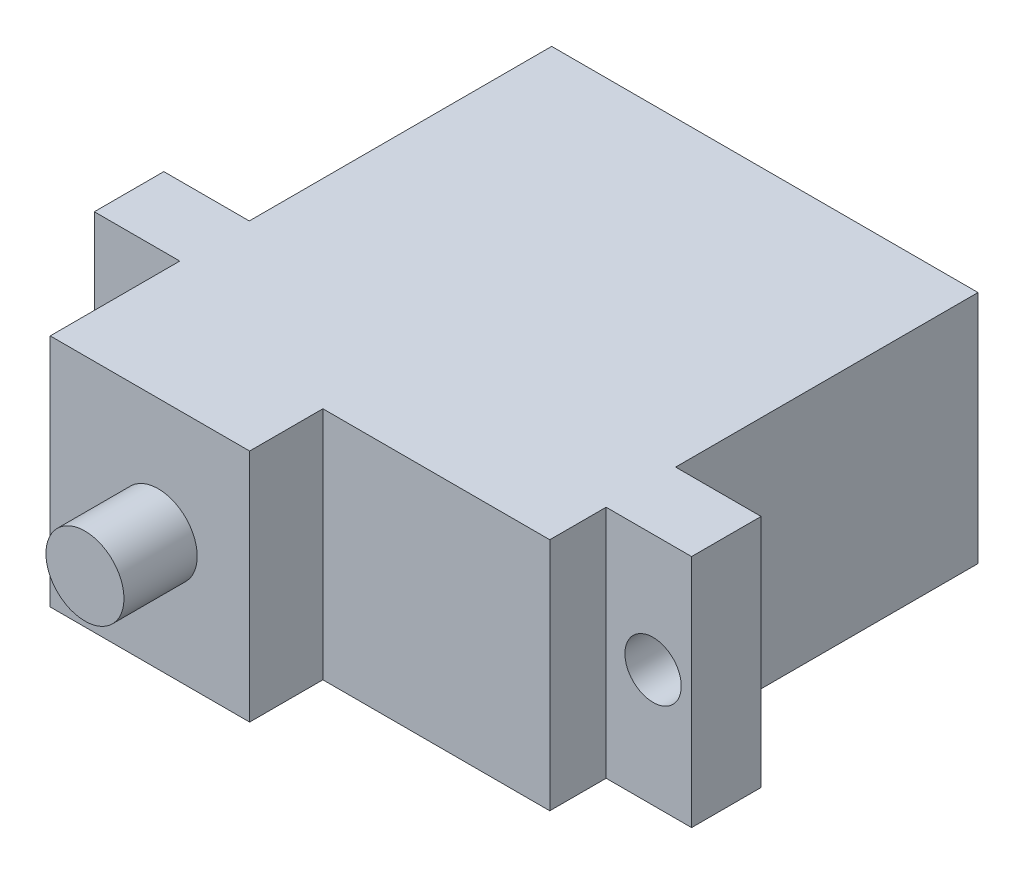
ISO-10303-21;
HEADER;
FILE_DESCRIPTION(('STEP AP214'),'2;1');
FILE_NAME('part.step','',(''),(''),'','','');
FILE_SCHEMA(('AUTOMOTIVE_DESIGN { 1 0 10303 214 1 1 1 1 }'));
ENDSEC;
DATA;
#1=APPLICATION_CONTEXT('core data for automotive mechanical design processes');
#2=APPLICATION_PROTOCOL_DEFINITION('international standard','automotive_design',2000,#1);
#3=PRODUCT_CONTEXT('',#1,'mechanical');
#4=PRODUCT('Part','Part','',(#3));
#5=PRODUCT_RELATED_PRODUCT_CATEGORY('part','',(#4));
#6=PRODUCT_DEFINITION_FORMATION('','',#4);
#7=PRODUCT_DEFINITION_CONTEXT('part definition',#1,'design');
#8=PRODUCT_DEFINITION('design','',#6,#7);
#9=PRODUCT_DEFINITION_SHAPE('','',#8);
#10=(LENGTH_UNIT() NAMED_UNIT(*) SI_UNIT(.MILLI.,.METRE.));
#11=(NAMED_UNIT(*) PLANE_ANGLE_UNIT() SI_UNIT($,.RADIAN.));
#12=(NAMED_UNIT(*) SI_UNIT($,.STERADIAN.) SOLID_ANGLE_UNIT());
#13=UNCERTAINTY_MEASURE_WITH_UNIT(LENGTH_MEASURE(1.E-05),#10,'distance_accuracy_value','');
#14=(GEOMETRIC_REPRESENTATION_CONTEXT(3) GLOBAL_UNCERTAINTY_ASSIGNED_CONTEXT((#13)) GLOBAL_UNIT_ASSIGNED_CONTEXT((#10,
#11,#12)) REPRESENTATION_CONTEXT('',''));
#15=CARTESIAN_POINT('',(0.,0.,0.));
#16=DIRECTION('',(0.,0.,1.));
#17=DIRECTION('',(1.,0.,0.));
#18=AXIS2_PLACEMENT_3D('',#15,#16,#17);
#19=CARTESIAN_POINT('',(11.35,6.25,22.8));
#20=DIRECTION('',(-1.,0.,0.));
#21=DIRECTION('',(0.,0.,1.));
#22=AXIS2_PLACEMENT_3D('',#19,#20,#21);
#23=PLANE('',#22);
#24=DIRECTION('',(0.,0.,-1.));
#25=VECTOR('',#24,1.);
#26=CARTESIAN_POINT('',(11.35,6.25,22.8));
#27=LINE('',#26,#25);
#28=CARTESIAN_POINT('',(11.35,6.25,16.1));
#29=VERTEX_POINT('',#28);
#30=CARTESIAN_POINT('',(11.35,6.25,0.));
#31=VERTEX_POINT('',#30);
#32=EDGE_CURVE('E44',#29,#31,#27,.T.);
#33=ORIENTED_EDGE('',*,*,#32,.F.);
#34=DIRECTION('',(0.,-1.,0.));
#35=VECTOR('',#34,1.);
#36=CARTESIAN_POINT('',(11.35,0.,16.1));
#37=LINE('',#36,#35);
#38=CARTESIAN_POINT('',(11.35,-6.25,16.1));
#39=VERTEX_POINT('',#38);
#40=EDGE_CURVE('E217',#29,#39,#37,.T.);
#41=ORIENTED_EDGE('',*,*,#40,.T.);
#42=DIRECTION('',(0.,0.,-1.));
#43=VECTOR('',#42,1.);
#44=CARTESIAN_POINT('',(11.35,-6.25,22.8));
#45=LINE('',#44,#43);
#46=CARTESIAN_POINT('',(11.35,-6.25,0.));
#47=VERTEX_POINT('',#46);
#48=EDGE_CURVE('E255',#39,#47,#45,.T.);
#49=ORIENTED_EDGE('',*,*,#48,.T.);
#50=DIRECTION('',(0.,1.,0.));
#51=VECTOR('',#50,1.);
#52=CARTESIAN_POINT('',(11.35,6.25,0.));
#53=LINE('',#52,#51);
#54=EDGE_CURVE('E249',#47,#31,#53,.T.);
#55=ORIENTED_EDGE('',*,*,#54,.T.);
#56=EDGE_LOOP('',(#33,#41,#49,#55));
#57=FACE_BOUND('',#56,.T.);
#58=ADVANCED_FACE('F41',(#57),#23,.F.);
#59=CARTESIAN_POINT('',(-11.35,6.25,22.8));
#60=DIRECTION('',(0.,-1.,0.));
#61=DIRECTION('',(0.,0.,-1.));
#62=AXIS2_PLACEMENT_3D('',#59,#60,#61);
#63=PLANE('',#62);
#64=DIRECTION('',(1.,0.,0.));
#65=VECTOR('',#64,1.);
#66=CARTESIAN_POINT('',(-15.9,6.25,19.8));
#67=LINE('',#66,#65);
#68=CARTESIAN_POINT('',(-15.9,6.25,19.8));
#69=VERTEX_POINT('',#68);
#70=CARTESIAN_POINT('',(-11.35,6.25,19.8));
#71=VERTEX_POINT('',#70);
#72=EDGE_CURVE('E64',#69,#71,#67,.T.);
#73=ORIENTED_EDGE('',*,*,#72,.T.);
#74=DIRECTION('',(0.,0.,1.));
#75=VECTOR('',#74,1.);
#76=CARTESIAN_POINT('',(-11.35,6.25,22.8));
#77=LINE('',#76,#75);
#78=CARTESIAN_POINT('',(-11.35,6.25,26.7));
#79=VERTEX_POINT('',#78);
#80=EDGE_CURVE('E192',#71,#79,#77,.T.);
#81=ORIENTED_EDGE('',*,*,#80,.T.);
#82=DIRECTION('',(-1.,0.,0.));
#83=VECTOR('',#82,1.);
#84=CARTESIAN_POINT('',(-11.35,6.25,26.7));
#85=LINE('',#84,#83);
#86=CARTESIAN_POINT('',(-0.73128607064632,6.25,26.7));
#87=VERTEX_POINT('',#86);
#88=EDGE_CURVE('E166',#87,#79,#85,.T.);
#89=ORIENTED_EDGE('',*,*,#88,.F.);
#90=DIRECTION('',(0.,0.,-1.));
#91=VECTOR('',#90,1.);
#92=CARTESIAN_POINT('',(-0.73128607064632,6.25,26.7));
#93=LINE('',#92,#91);
#94=CARTESIAN_POINT('',(-0.73128607064632,6.25,22.8));
#95=VERTEX_POINT('',#94);
#96=EDGE_CURVE('E173',#87,#95,#93,.T.);
#97=ORIENTED_EDGE('',*,*,#96,.T.);
#98=DIRECTION('',(-1.,0.,0.));
#99=VECTOR('',#98,1.);
#100=CARTESIAN_POINT('',(-11.35,6.25,22.8));
#101=LINE('',#100,#99);
#102=CARTESIAN_POINT('',(11.35,6.25,22.8));
#103=VERTEX_POINT('',#102);
#104=EDGE_CURVE('E250',#103,#95,#101,.T.);
#105=ORIENTED_EDGE('',*,*,#104,.F.);
#106=DIRECTION('',(0.,0.,-1.));
#107=VECTOR('',#106,1.);
#108=CARTESIAN_POINT('',(11.35,6.25,22.8));
#109=LINE('',#108,#107);
#110=CARTESIAN_POINT('',(11.35,6.25,19.8));
#111=VERTEX_POINT('',#110);
#112=EDGE_CURVE('E200',#103,#111,#109,.T.);
#113=ORIENTED_EDGE('',*,*,#112,.T.);
#114=DIRECTION('',(1.,0.,0.));
#115=VECTOR('',#114,1.);
#116=CARTESIAN_POINT('',(15.9,6.25,19.8));
#117=LINE('',#116,#115);
#118=CARTESIAN_POINT('',(15.9,6.25,19.8));
#119=VERTEX_POINT('',#118);
#120=EDGE_CURVE('E203',#111,#119,#117,.T.);
#121=ORIENTED_EDGE('',*,*,#120,.T.);
#122=DIRECTION('',(0.,0.,1.));
#123=VECTOR('',#122,1.);
#124=CARTESIAN_POINT('',(15.9,6.25,-13.3023494165505));
#125=LINE('',#124,#123);
#126=CARTESIAN_POINT('',(15.9,6.25,16.1));
#127=VERTEX_POINT('',#126);
#128=EDGE_CURVE('E198',#127,#119,#125,.T.);
#129=ORIENTED_EDGE('',*,*,#128,.F.);
#130=DIRECTION('',(-1.,0.,0.));
#131=VECTOR('',#130,1.);
#132=CARTESIAN_POINT('',(0.,6.25,16.1));
#133=LINE('',#132,#131);
#134=EDGE_CURVE('E221',#127,#29,#133,.T.);
#135=ORIENTED_EDGE('',*,*,#134,.T.);
#136=ORIENTED_EDGE('',*,*,#32,.T.);
#137=DIRECTION('',(-1.,0.,0.));
#138=VECTOR('',#137,1.);
#139=CARTESIAN_POINT('',(-11.35,6.25,0.));
#140=LINE('',#139,#138);
#141=CARTESIAN_POINT('',(-11.35,6.25,0.));
#142=VERTEX_POINT('',#141);
#143=EDGE_CURVE('E258',#31,#142,#140,.T.);
#144=ORIENTED_EDGE('',*,*,#143,.T.);
#145=DIRECTION('',(0.,0.,-1.));
#146=VECTOR('',#145,1.);
#147=CARTESIAN_POINT('',(-11.35,6.25,22.8));
#148=LINE('',#147,#146);
#149=CARTESIAN_POINT('',(-11.35,6.25,16.1));
#150=VERTEX_POINT('',#149);
#151=EDGE_CURVE('E268',#150,#142,#148,.T.);
#152=ORIENTED_EDGE('',*,*,#151,.F.);
#153=DIRECTION('',(-1.,0.,0.));
#154=VECTOR('',#153,1.);
#155=CARTESIAN_POINT('',(0.,6.25,16.1));
#156=LINE('',#155,#154);
#157=CARTESIAN_POINT('',(-15.9,6.25,16.1));
#158=VERTEX_POINT('',#157);
#159=EDGE_CURVE('E237',#150,#158,#156,.T.);
#160=ORIENTED_EDGE('',*,*,#159,.T.);
#161=DIRECTION('',(0.,0.,1.));
#162=VECTOR('',#161,1.);
#163=CARTESIAN_POINT('',(-15.9,6.25,-13.3023494165505));
#164=LINE('',#163,#162);
#165=EDGE_CURVE('E238',#158,#69,#164,.T.);
#166=ORIENTED_EDGE('',*,*,#165,.T.);
#167=EDGE_LOOP('',(#73,#81,#89,#97,#105,#113,#121,#129,#135,#136,#144,#152,#160,#166));
#168=FACE_BOUND('',#167,.T.);
#169=ADVANCED_FACE('F274',(#168),#63,.F.);
#170=CARTESIAN_POINT('',(-11.35,6.25,22.8));
#171=DIRECTION('',(1.,0.,0.));
#172=DIRECTION('',(0.,0.,-1.));
#173=AXIS2_PLACEMENT_3D('',#170,#171,#172);
#174=PLANE('',#173);
#175=DIRECTION('',(0.,0.,-1.));
#176=VECTOR('',#175,1.);
#177=CARTESIAN_POINT('',(-11.35,-6.25,22.8));
#178=LINE('',#177,#176);
#179=CARTESIAN_POINT('',(-11.35,-6.25,16.1));
#180=VERTEX_POINT('',#179);
#181=CARTESIAN_POINT('',(-11.35,-6.25,0.));
#182=VERTEX_POINT('',#181);
#183=EDGE_CURVE('E267',#180,#182,#178,.T.);
#184=ORIENTED_EDGE('',*,*,#183,.F.);
#185=DIRECTION('',(0.,1.,0.));
#186=VECTOR('',#185,1.);
#187=CARTESIAN_POINT('',(-11.35,0.,16.1));
#188=LINE('',#187,#186);
#189=EDGE_CURVE('E234',#180,#150,#188,.T.);
#190=ORIENTED_EDGE('',*,*,#189,.T.);
#191=ORIENTED_EDGE('',*,*,#151,.T.);
#192=DIRECTION('',(0.,-1.,0.));
#193=VECTOR('',#192,1.);
#194=CARTESIAN_POINT('',(-11.35,6.25,0.));
#195=LINE('',#194,#193);
#196=EDGE_CURVE('E261',#142,#182,#195,.T.);
#197=ORIENTED_EDGE('',*,*,#196,.T.);
#198=EDGE_LOOP('',(#184,#190,#191,#197));
#199=FACE_BOUND('',#198,.T.);
#200=ADVANCED_FACE('F287',(#199),#174,.F.);
#201=CARTESIAN_POINT('',(-11.35,-6.25,22.8));
#202=DIRECTION('',(0.,1.,0.));
#203=DIRECTION('',(0.,0.,1.));
#204=AXIS2_PLACEMENT_3D('',#201,#202,#203);
#205=PLANE('',#204);
#206=DIRECTION('',(1.,0.,0.));
#207=VECTOR('',#206,1.);
#208=CARTESIAN_POINT('',(-11.35,-6.25,22.8));
#209=LINE('',#208,#207);
#210=CARTESIAN_POINT('',(-0.73128607064632,-6.25,22.8));
#211=VERTEX_POINT('',#210);
#212=CARTESIAN_POINT('',(11.35,-6.25,22.8));
#213=VERTEX_POINT('',#212);
#214=EDGE_CURVE('E252',#211,#213,#209,.T.);
#215=ORIENTED_EDGE('',*,*,#214,.F.);
#216=DIRECTION('',(0.,0.,-1.));
#217=VECTOR('',#216,1.);
#218=CARTESIAN_POINT('',(-0.73128607064632,-6.25,26.7));
#219=LINE('',#218,#217);
#220=CARTESIAN_POINT('',(-0.73128607064632,-6.25,26.7));
#221=VERTEX_POINT('',#220);
#222=EDGE_CURVE('E158',#221,#211,#219,.T.);
#223=ORIENTED_EDGE('',*,*,#222,.F.);
#224=DIRECTION('',(1.,0.,0.));
#225=VECTOR('',#224,1.);
#226=CARTESIAN_POINT('',(-11.35,-6.25,26.7));
#227=LINE('',#226,#225);
#228=CARTESIAN_POINT('',(-11.35,-6.25,26.7));
#229=VERTEX_POINT('',#228);
#230=EDGE_CURVE('E155',#229,#221,#227,.T.);
#231=ORIENTED_EDGE('',*,*,#230,.F.);
#232=DIRECTION('',(0.,0.,1.));
#233=VECTOR('',#232,1.);
#234=CARTESIAN_POINT('',(-11.35,-6.25,22.8));
#235=LINE('',#234,#233);
#236=CARTESIAN_POINT('',(-11.35,-6.25,19.8));
#237=VERTEX_POINT('',#236);
#238=EDGE_CURVE('E142',#237,#229,#235,.T.);
#239=ORIENTED_EDGE('',*,*,#238,.F.);
#240=DIRECTION('',(1.,0.,0.));
#241=VECTOR('',#240,1.);
#242=CARTESIAN_POINT('',(-15.9,-6.25,19.8));
#243=LINE('',#242,#241);
#244=CARTESIAN_POINT('',(-15.9,-6.25,19.8));
#245=VERTEX_POINT('',#244);
#246=EDGE_CURVE('E152',#245,#237,#243,.T.);
#247=ORIENTED_EDGE('',*,*,#246,.F.);
#248=DIRECTION('',(0.,0.,1.));
#249=VECTOR('',#248,1.);
#250=CARTESIAN_POINT('',(-15.9,-6.25,-13.3023494165505));
#251=LINE('',#250,#249);
#252=CARTESIAN_POINT('',(-15.9,-6.25,16.1));
#253=VERTEX_POINT('',#252);
#254=EDGE_CURVE('E226',#253,#245,#251,.T.);
#255=ORIENTED_EDGE('',*,*,#254,.F.);
#256=DIRECTION('',(-1.,0.,0.));
#257=VECTOR('',#256,1.);
#258=CARTESIAN_POINT('',(0.,-6.25,16.1));
#259=LINE('',#258,#257);
#260=EDGE_CURVE('E243',#180,#253,#259,.T.);
#261=ORIENTED_EDGE('',*,*,#260,.F.);
#262=ORIENTED_EDGE('',*,*,#183,.T.);
#263=DIRECTION('',(1.,0.,0.));
#264=VECTOR('',#263,1.);
#265=CARTESIAN_POINT('',(-11.35,-6.25,0.));
#266=LINE('',#265,#264);
#267=EDGE_CURVE('E253',#182,#47,#266,.T.);
#268=ORIENTED_EDGE('',*,*,#267,.T.);
#269=ORIENTED_EDGE('',*,*,#48,.F.);
#270=DIRECTION('',(-1.,0.,0.));
#271=VECTOR('',#270,1.);
#272=CARTESIAN_POINT('',(0.,-6.25,16.1));
#273=LINE('',#272,#271);
#274=CARTESIAN_POINT('',(15.9,-6.25,16.1));
#275=VERTEX_POINT('',#274);
#276=EDGE_CURVE('E220',#275,#39,#273,.T.);
#277=ORIENTED_EDGE('',*,*,#276,.F.);
#278=DIRECTION('',(0.,0.,1.));
#279=VECTOR('',#278,1.);
#280=CARTESIAN_POINT('',(15.9,-6.25,-13.3023494165505));
#281=LINE('',#280,#279);
#282=CARTESIAN_POINT('',(15.9,-6.25,19.8));
#283=VERTEX_POINT('',#282);
#284=EDGE_CURVE('E227',#275,#283,#281,.T.);
#285=ORIENTED_EDGE('',*,*,#284,.T.);
#286=DIRECTION('',(1.,0.,0.));
#287=VECTOR('',#286,1.);
#288=CARTESIAN_POINT('',(15.9,-6.25,19.8));
#289=LINE('',#288,#287);
#290=CARTESIAN_POINT('',(11.35,-6.25,19.8));
#291=VERTEX_POINT('',#290);
#292=EDGE_CURVE('E204',#291,#283,#289,.T.);
#293=ORIENTED_EDGE('',*,*,#292,.F.);
#294=DIRECTION('',(0.,0.,-1.));
#295=VECTOR('',#294,1.);
#296=CARTESIAN_POINT('',(11.35,-6.25,22.8));
#297=LINE('',#296,#295);
#298=EDGE_CURVE('E190',#213,#291,#297,.T.);
#299=ORIENTED_EDGE('',*,*,#298,.F.);
#300=EDGE_LOOP('',(#215,#223,#231,#239,#247,#255,#261,#262,#268,#269,#277,#285,#293,#299));
#301=FACE_BOUND('',#300,.T.);
#302=ADVANCED_FACE('F156',(#301),#205,.F.);
#303=CARTESIAN_POINT('',(0.,0.,22.8));
#304=DIRECTION('',(0.,0.,1.));
#305=DIRECTION('',(1.,0.,0.));
#306=AXIS2_PLACEMENT_3D('',#303,#304,#305);
#307=PLANE('',#306);
#308=DIRECTION('',(0.,1.,0.));
#309=VECTOR('',#308,1.);
#310=CARTESIAN_POINT('',(-0.73128607064632,6.25,22.8));
#311=LINE('',#310,#309);
#312=EDGE_CURVE('E56',#211,#95,#311,.T.);
#313=ORIENTED_EDGE('',*,*,#312,.F.);
#314=ORIENTED_EDGE('',*,*,#214,.T.);
#315=DIRECTION('',(0.,-1.,0.));
#316=VECTOR('',#315,1.);
#317=CARTESIAN_POINT('',(11.35,6.25,22.8));
#318=LINE('',#317,#316);
#319=EDGE_CURVE('E207',#103,#213,#318,.T.);
#320=ORIENTED_EDGE('',*,*,#319,.F.);
#321=ORIENTED_EDGE('',*,*,#104,.T.);
#322=EDGE_LOOP('',(#313,#314,#320,#321));
#323=FACE_BOUND('',#322,.T.);
#324=ADVANCED_FACE('F294',(#323),#307,.T.);
#325=CARTESIAN_POINT('',(0.,0.,0.));
#326=DIRECTION('',(0.,0.,1.));
#327=DIRECTION('',(1.,0.,0.));
#328=AXIS2_PLACEMENT_3D('',#325,#326,#327);
#329=PLANE('',#328);
#330=ORIENTED_EDGE('',*,*,#54,.F.);
#331=ORIENTED_EDGE('',*,*,#267,.F.);
#332=ORIENTED_EDGE('',*,*,#196,.F.);
#333=ORIENTED_EDGE('',*,*,#143,.F.);
#334=EDGE_LOOP('',(#330,#331,#332,#333));
#335=FACE_BOUND('',#334,.T.);
#336=ADVANCED_FACE('F280',(#335),#329,.F.);
#337=CARTESIAN_POINT('',(-15.9,0.,-13.3023494165505));
#338=DIRECTION('',(-1.,0.,0.));
#339=DIRECTION('',(0.,0.,1.));
#340=AXIS2_PLACEMENT_3D('',#337,#338,#339);
#341=PLANE('',#340);
#342=DIRECTION('',(0.,-1.,0.));
#343=VECTOR('',#342,1.);
#344=CARTESIAN_POINT('',(-15.9,6.25,19.8));
#345=LINE('',#344,#343);
#346=EDGE_CURVE('E194',#69,#245,#345,.T.);
#347=ORIENTED_EDGE('',*,*,#346,.F.);
#348=ORIENTED_EDGE('',*,*,#165,.F.);
#349=DIRECTION('',(0.,1.,0.));
#350=VECTOR('',#349,1.);
#351=CARTESIAN_POINT('',(-15.9,0.,16.1));
#352=LINE('',#351,#350);
#353=EDGE_CURVE('E241',#253,#158,#352,.T.);
#354=ORIENTED_EDGE('',*,*,#353,.F.);
#355=ORIENTED_EDGE('',*,*,#254,.T.);
#356=EDGE_LOOP('',(#347,#348,#354,#355));
#357=FACE_BOUND('',#356,.T.);
#358=ADVANCED_FACE('F412',(#357),#341,.T.);
#359=CARTESIAN_POINT('',(0.,0.,16.1));
#360=DIRECTION('',(0.,0.,1.));
#361=DIRECTION('',(1.,0.,0.));
#362=AXIS2_PLACEMENT_3D('',#359,#360,#361);
#363=PLANE('',#362);
#364=CARTESIAN_POINT('',(-13.85,0.,16.1));
#365=DIRECTION('',(0.,0.,1.));
#366=DIRECTION('',(1.,0.,0.));
#367=AXIS2_PLACEMENT_3D('',#364,#365,#366);
#368=CIRCLE('',#367,1.5);
#369=CARTESIAN_POINT('',(-12.35,0.,16.1));
#370=VERTEX_POINT('',#369);
#371=EDGE_CURVE('E182',#370,#370,#368,.T.);
#372=ORIENTED_EDGE('',*,*,#371,.T.);
#373=EDGE_LOOP('',(#372));
#374=FACE_BOUND('',#373,.T.);
#375=ORIENTED_EDGE('',*,*,#353,.T.);
#376=ORIENTED_EDGE('',*,*,#159,.F.);
#377=ORIENTED_EDGE('',*,*,#189,.F.);
#378=ORIENTED_EDGE('',*,*,#260,.T.);
#379=EDGE_LOOP('',(#375,#376,#377,#378));
#380=FACE_BOUND('',#379,.T.);
#381=ADVANCED_FACE('F408',(#374,#380),#363,.F.);
#382=CARTESIAN_POINT('',(15.9,0.,-13.3023494165505));
#383=DIRECTION('',(-1.,0.,0.));
#384=DIRECTION('',(0.,-1.,0.));
#385=AXIS2_PLACEMENT_3D('',#382,#383,#384);
#386=PLANE('',#385);
#387=ORIENTED_EDGE('',*,*,#128,.T.);
#388=DIRECTION('',(0.,-1.,0.));
#389=VECTOR('',#388,1.);
#390=CARTESIAN_POINT('',(15.9,6.25,19.8));
#391=LINE('',#390,#389);
#392=EDGE_CURVE('E195',#119,#283,#391,.T.);
#393=ORIENTED_EDGE('',*,*,#392,.T.);
#394=ORIENTED_EDGE('',*,*,#284,.F.);
#395=DIRECTION('',(0.,1.,0.));
#396=VECTOR('',#395,1.);
#397=CARTESIAN_POINT('',(15.9,0.,16.1));
#398=LINE('',#397,#396);
#399=EDGE_CURVE('E223',#275,#127,#398,.T.);
#400=ORIENTED_EDGE('',*,*,#399,.T.);
#401=EDGE_LOOP('',(#387,#393,#394,#400));
#402=FACE_BOUND('',#401,.T.);
#403=ADVANCED_FACE('F404',(#402),#386,.F.);
#404=CARTESIAN_POINT('',(0.,0.,16.1));
#405=DIRECTION('',(0.,0.,1.));
#406=DIRECTION('',(1.,0.,0.));
#407=AXIS2_PLACEMENT_3D('',#404,#405,#406);
#408=PLANE('',#407);
#409=CARTESIAN_POINT('',(13.85,0.,16.1));
#410=DIRECTION('',(0.,0.,1.));
#411=DIRECTION('',(1.,0.,0.));
#412=AXIS2_PLACEMENT_3D('',#409,#410,#411);
#413=CIRCLE('',#412,1.5);
#414=CARTESIAN_POINT('',(15.35,0.,16.1));
#415=VERTEX_POINT('',#414);
#416=EDGE_CURVE('E187',#415,#415,#413,.T.);
#417=ORIENTED_EDGE('',*,*,#416,.T.);
#418=EDGE_LOOP('',(#417));
#419=FACE_BOUND('',#418,.T.);
#420=ORIENTED_EDGE('',*,*,#276,.T.);
#421=ORIENTED_EDGE('',*,*,#40,.F.);
#422=ORIENTED_EDGE('',*,*,#134,.F.);
#423=ORIENTED_EDGE('',*,*,#399,.F.);
#424=EDGE_LOOP('',(#420,#421,#422,#423));
#425=FACE_BOUND('',#424,.T.);
#426=ADVANCED_FACE('F398',(#419,#425),#408,.F.);
#427=CARTESIAN_POINT('',(15.9,6.25,19.8));
#428=DIRECTION('',(0.,0.,-1.));
#429=DIRECTION('',(-1.,0.,0.));
#430=AXIS2_PLACEMENT_3D('',#427,#428,#429);
#431=PLANE('',#430);
#432=CARTESIAN_POINT('',(13.85,0.,19.8));
#433=DIRECTION('',(0.,0.,1.));
#434=DIRECTION('',(1.,0.,0.));
#435=AXIS2_PLACEMENT_3D('',#432,#433,#434);
#436=CIRCLE('',#435,1.5);
#437=CARTESIAN_POINT('',(15.35,0.,19.8));
#438=VERTEX_POINT('',#437);
#439=EDGE_CURVE('E179',#438,#438,#436,.T.);
#440=ORIENTED_EDGE('',*,*,#439,.F.);
#441=EDGE_LOOP('',(#440));
#442=FACE_BOUND('',#441,.T.);
#443=ORIENTED_EDGE('',*,*,#292,.T.);
#444=ORIENTED_EDGE('',*,*,#392,.F.);
#445=ORIENTED_EDGE('',*,*,#120,.F.);
#446=DIRECTION('',(0.,-1.,0.));
#447=VECTOR('',#446,1.);
#448=CARTESIAN_POINT('',(11.35,6.25,19.8));
#449=LINE('',#448,#447);
#450=EDGE_CURVE('E213',#111,#291,#449,.T.);
#451=ORIENTED_EDGE('',*,*,#450,.T.);
#452=EDGE_LOOP('',(#443,#444,#445,#451));
#453=FACE_BOUND('',#452,.T.);
#454=ADVANCED_FACE('F395',(#442,#453),#431,.F.);
#455=CARTESIAN_POINT('',(11.35,6.25,22.8));
#456=DIRECTION('',(-1.,0.,0.));
#457=DIRECTION('',(0.,0.,1.));
#458=AXIS2_PLACEMENT_3D('',#455,#456,#457);
#459=PLANE('',#458);
#460=ORIENTED_EDGE('',*,*,#298,.T.);
#461=ORIENTED_EDGE('',*,*,#450,.F.);
#462=ORIENTED_EDGE('',*,*,#112,.F.);
#463=ORIENTED_EDGE('',*,*,#319,.T.);
#464=EDGE_LOOP('',(#460,#461,#462,#463));
#465=FACE_BOUND('',#464,.T.);
#466=ADVANCED_FACE('F339',(#465),#459,.F.);
#467=CARTESIAN_POINT('',(-11.35,6.25,22.8));
#468=DIRECTION('',(1.,0.,0.));
#469=DIRECTION('',(0.,0.,-1.));
#470=AXIS2_PLACEMENT_3D('',#467,#468,#469);
#471=PLANE('',#470);
#472=ORIENTED_EDGE('',*,*,#238,.T.);
#473=DIRECTION('',(0.,-1.,0.));
#474=VECTOR('',#473,1.);
#475=CARTESIAN_POINT('',(-11.35,6.25,26.7));
#476=LINE('',#475,#474);
#477=EDGE_CURVE('E147',#79,#229,#476,.T.);
#478=ORIENTED_EDGE('',*,*,#477,.F.);
#479=ORIENTED_EDGE('',*,*,#80,.F.);
#480=DIRECTION('',(0.,-1.,0.));
#481=VECTOR('',#480,1.);
#482=CARTESIAN_POINT('',(-11.35,6.25,19.8));
#483=LINE('',#482,#481);
#484=EDGE_CURVE('E148',#71,#237,#483,.T.);
#485=ORIENTED_EDGE('',*,*,#484,.T.);
#486=EDGE_LOOP('',(#472,#478,#479,#485));
#487=FACE_BOUND('',#486,.T.);
#488=ADVANCED_FACE('F144',(#487),#471,.F.);
#489=CARTESIAN_POINT('',(-15.9,6.25,19.8));
#490=DIRECTION('',(0.,0.,-1.));
#491=DIRECTION('',(-1.,0.,0.));
#492=AXIS2_PLACEMENT_3D('',#489,#490,#491);
#493=PLANE('',#492);
#494=CARTESIAN_POINT('',(-13.85,0.,19.8));
#495=DIRECTION('',(0.,0.,1.));
#496=DIRECTION('',(-1.,0.,0.));
#497=AXIS2_PLACEMENT_3D('',#494,#495,#496);
#498=CIRCLE('',#497,1.5);
#499=CARTESIAN_POINT('',(-15.35,0.,19.8));
#500=VERTEX_POINT('',#499);
#501=EDGE_CURVE('E178',#500,#500,#498,.T.);
#502=ORIENTED_EDGE('',*,*,#501,.F.);
#503=EDGE_LOOP('',(#502));
#504=FACE_BOUND('',#503,.T.);
#505=ORIENTED_EDGE('',*,*,#246,.T.);
#506=ORIENTED_EDGE('',*,*,#484,.F.);
#507=ORIENTED_EDGE('',*,*,#72,.F.);
#508=ORIENTED_EDGE('',*,*,#346,.T.);
#509=EDGE_LOOP('',(#505,#506,#507,#508));
#510=FACE_BOUND('',#509,.T.);
#511=ADVANCED_FACE('F338',(#504,#510),#493,.F.);
#512=CARTESIAN_POINT('',(-13.85,0.,3.7));
#513=DIRECTION('',(0.,0.,1.));
#514=DIRECTION('',(1.,0.,0.));
#515=AXIS2_PLACEMENT_3D('',#512,#513,#514);
#516=CYLINDRICAL_SURFACE('',#515,1.5);
#517=ORIENTED_EDGE('',*,*,#501,.T.);
#518=EDGE_LOOP('',(#517));
#519=FACE_BOUND('',#518,.T.);
#520=ORIENTED_EDGE('',*,*,#371,.F.);
#521=EDGE_LOOP('',(#520));
#522=FACE_BOUND('',#521,.T.);
#523=ADVANCED_FACE('F388',(#519,#522),#516,.F.);
#524=CARTESIAN_POINT('',(13.85,0.,3.7));
#525=DIRECTION('',(0.,0.,1.));
#526=DIRECTION('',(1.,0.,0.));
#527=AXIS2_PLACEMENT_3D('',#524,#525,#526);
#528=CYLINDRICAL_SURFACE('',#527,1.5);
#529=ORIENTED_EDGE('',*,*,#439,.T.);
#530=EDGE_LOOP('',(#529));
#531=FACE_BOUND('',#530,.T.);
#532=ORIENTED_EDGE('',*,*,#416,.F.);
#533=EDGE_LOOP('',(#532));
#534=FACE_BOUND('',#533,.T.);
#535=ADVANCED_FACE('F313',(#531,#534),#528,.F.);
#536=CARTESIAN_POINT('',(-0.73128607064632,6.25,26.7));
#537=DIRECTION('',(-1.,0.,0.));
#538=DIRECTION('',(0.,0.,1.));
#539=AXIS2_PLACEMENT_3D('',#536,#537,#538);
#540=PLANE('',#539);
#541=ORIENTED_EDGE('',*,*,#312,.T.);
#542=ORIENTED_EDGE('',*,*,#96,.F.);
#543=DIRECTION('',(0.,1.,0.));
#544=VECTOR('',#543,1.);
#545=CARTESIAN_POINT('',(-0.73128607064632,6.25,26.7));
#546=LINE('',#545,#544);
#547=EDGE_CURVE('E161',#221,#87,#546,.T.);
#548=ORIENTED_EDGE('',*,*,#547,.F.);
#549=ORIENTED_EDGE('',*,*,#222,.T.);
#550=EDGE_LOOP('',(#541,#542,#548,#549));
#551=FACE_BOUND('',#550,.T.);
#552=ADVANCED_FACE('F348',(#551),#540,.F.);
#553=CARTESIAN_POINT('',(0.,0.,26.7));
#554=DIRECTION('',(0.,0.,1.));
#555=DIRECTION('',(1.,0.,0.));
#556=AXIS2_PLACEMENT_3D('',#553,#554,#555);
#557=PLANE('',#556);
#558=CARTESIAN_POINT('',(-5.6,0.,26.7));
#559=DIRECTION('',(0.,0.,1.));
#560=DIRECTION('',(1.,0.,0.));
#561=AXIS2_PLACEMENT_3D('',#558,#559,#560);
#562=CIRCLE('',#561,2.07758133365132);
#563=CARTESIAN_POINT('',(-3.52241866634868,0.,26.7));
#564=VERTEX_POINT('',#563);
#565=EDGE_CURVE('E12',#564,#564,#562,.T.);
#566=ORIENTED_EDGE('',*,*,#565,.F.);
#567=EDGE_LOOP('',(#566));
#568=FACE_BOUND('',#567,.T.);
#569=ORIENTED_EDGE('',*,*,#477,.T.);
#570=ORIENTED_EDGE('',*,*,#230,.T.);
#571=ORIENTED_EDGE('',*,*,#547,.T.);
#572=ORIENTED_EDGE('',*,*,#88,.T.);
#573=EDGE_LOOP('',(#569,#570,#571,#572));
#574=FACE_BOUND('',#573,.T.);
#575=ADVANCED_FACE('F164',(#568,#574),#557,.T.);
#576=CARTESIAN_POINT('',(-5.6,0.,30.6));
#577=DIRECTION('',(0.,0.,-1.));
#578=DIRECTION('',(-1.,0.,0.));
#579=AXIS2_PLACEMENT_3D('',#576,#577,#578);
#580=CYLINDRICAL_SURFACE('',#579,2.07758133365132);
#581=CARTESIAN_POINT('',(-5.6,0.,30.6));
#582=DIRECTION('',(0.,0.,1.));
#583=DIRECTION('',(1.,0.,0.));
#584=AXIS2_PLACEMENT_3D('',#581,#582,#583);
#585=CIRCLE('',#584,2.07758133365132);
#586=CARTESIAN_POINT('',(-3.52241866634868,0.,30.6));
#587=VERTEX_POINT('',#586);
#588=EDGE_CURVE('E168',#587,#587,#585,.T.);
#589=ORIENTED_EDGE('',*,*,#588,.F.);
#590=EDGE_LOOP('',(#589));
#591=FACE_BOUND('',#590,.T.);
#592=ORIENTED_EDGE('',*,*,#565,.T.);
#593=EDGE_LOOP('',(#592));
#594=FACE_BOUND('',#593,.T.);
#595=ADVANCED_FACE('F361',(#591,#594),#580,.T.);
#596=CARTESIAN_POINT('',(-5.6,0.,30.6));
#597=DIRECTION('',(0.,0.,1.));
#598=DIRECTION('',(1.,0.,0.));
#599=AXIS2_PLACEMENT_3D('',#596,#597,#598);
#600=PLANE('',#599);
#601=ORIENTED_EDGE('',*,*,#588,.T.);
#602=EDGE_LOOP('',(#601));
#603=FACE_BOUND('',#602,.T.);
#604=ADVANCED_FACE('F371',(#603),#600,.T.);
#605=CLOSED_SHELL('',(#58,#169,#200,#302,#324,#336,#358,#381,#403,#426,#454,#466,#488,#511,#523,
#535,#552,#575,#595,#604));
#606=MANIFOLD_SOLID_BREP('B2',#605);
#607=ADVANCED_BREP_SHAPE_REPRESENTATION('',(#18,#606),#14);
#608=SHAPE_DEFINITION_REPRESENTATION(#9,#607);
ENDSEC;
END-ISO-10303-21;
